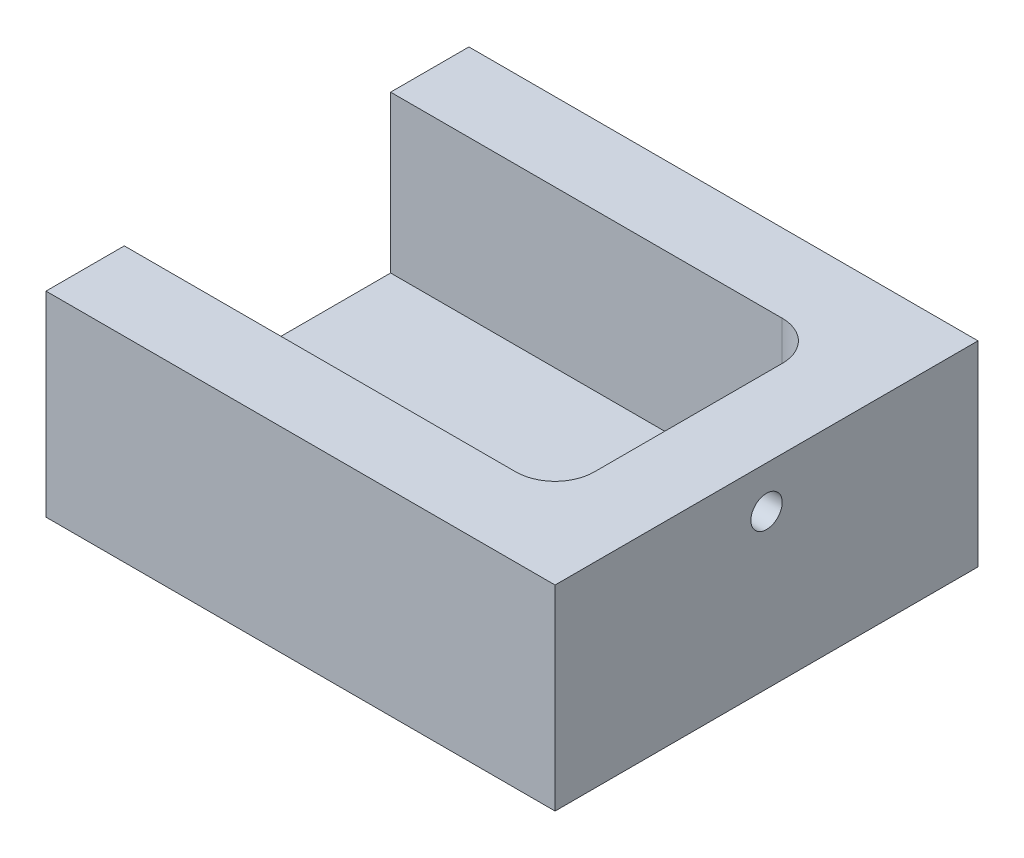
ISO-10303-21;
HEADER;
FILE_DESCRIPTION(('STEP AP214'),'2;1');
FILE_NAME('part.step','',(''),(''),'','','');
FILE_SCHEMA(('AUTOMOTIVE_DESIGN { 1 0 10303 214 1 1 1 1 }'));
ENDSEC;
DATA;
#1=APPLICATION_CONTEXT('core data for automotive mechanical design processes');
#2=APPLICATION_PROTOCOL_DEFINITION('international standard','automotive_design',2000,#1);
#3=PRODUCT_CONTEXT('',#1,'mechanical');
#4=PRODUCT('Part','Part','',(#3));
#5=PRODUCT_RELATED_PRODUCT_CATEGORY('part','',(#4));
#6=PRODUCT_DEFINITION_FORMATION('','',#4);
#7=PRODUCT_DEFINITION_CONTEXT('part definition',#1,'design');
#8=PRODUCT_DEFINITION('design','',#6,#7);
#9=PRODUCT_DEFINITION_SHAPE('','',#8);
#10=(LENGTH_UNIT() NAMED_UNIT(*) SI_UNIT(.MILLI.,.METRE.));
#11=(NAMED_UNIT(*) PLANE_ANGLE_UNIT() SI_UNIT($,.RADIAN.));
#12=(NAMED_UNIT(*) SI_UNIT($,.STERADIAN.) SOLID_ANGLE_UNIT());
#13=UNCERTAINTY_MEASURE_WITH_UNIT(LENGTH_MEASURE(1.E-05),#10,'distance_accuracy_value','');
#14=(GEOMETRIC_REPRESENTATION_CONTEXT(3) GLOBAL_UNCERTAINTY_ASSIGNED_CONTEXT((#13)) GLOBAL_UNIT_ASSIGNED_CONTEXT((#10,
#11,#12)) REPRESENTATION_CONTEXT('',''));
#15=CARTESIAN_POINT('',(0.,0.,0.));
#16=DIRECTION('',(0.,0.,1.));
#17=DIRECTION('',(1.,0.,0.));
#18=AXIS2_PLACEMENT_3D('',#15,#16,#17);
#19=CARTESIAN_POINT('',(0.,25.,0.));
#20=DIRECTION('',(1.,0.,0.));
#21=DIRECTION('',(0.,0.,-1.));
#22=AXIS2_PLACEMENT_3D('',#19,#20,#21);
#23=PLANE('',#22);
#24=DIRECTION('',(0.,0.,1.));
#25=VECTOR('',#24,1.);
#26=CARTESIAN_POINT('',(0.,5.,-44.));
#27=LINE('',#26,#25);
#28=CARTESIAN_POINT('',(0.,5.,-44.));
#29=VERTEX_POINT('',#28);
#30=CARTESIAN_POINT('',(0.,5.,-10.));
#31=VERTEX_POINT('',#30);
#32=EDGE_CURVE('E124',#29,#31,#27,.T.);
#33=ORIENTED_EDGE('',*,*,#32,.F.);
#34=DIRECTION('',(0.,1.,0.));
#35=VECTOR('',#34,1.);
#36=CARTESIAN_POINT('',(0.,5.,-44.));
#37=LINE('',#36,#35);
#38=CARTESIAN_POINT('',(0.,25.,-44.));
#39=VERTEX_POINT('',#38);
#40=EDGE_CURVE('E137',#29,#39,#37,.T.);
#41=ORIENTED_EDGE('',*,*,#40,.T.);
#42=DIRECTION('',(0.,0.,1.));
#43=VECTOR('',#42,1.);
#44=CARTESIAN_POINT('',(0.,25.,0.));
#45=LINE('',#44,#43);
#46=CARTESIAN_POINT('',(0.,25.,-54.));
#47=VERTEX_POINT('',#46);
#48=EDGE_CURVE('E144',#47,#39,#45,.T.);
#49=ORIENTED_EDGE('',*,*,#48,.F.);
#50=DIRECTION('',(0.,-1.,0.));
#51=VECTOR('',#50,1.);
#52=CARTESIAN_POINT('',(0.,25.,-54.));
#53=LINE('',#52,#51);
#54=CARTESIAN_POINT('',(0.,0.,-54.));
#55=VERTEX_POINT('',#54);
#56=EDGE_CURVE('E153',#47,#55,#53,.T.);
#57=ORIENTED_EDGE('',*,*,#56,.T.);
#58=DIRECTION('',(0.,0.,1.));
#59=VECTOR('',#58,1.);
#60=CARTESIAN_POINT('',(0.,0.,0.));
#61=LINE('',#60,#59);
#62=CARTESIAN_POINT('',(0.,0.,0.));
#63=VERTEX_POINT('',#62);
#64=EDGE_CURVE('E139',#55,#63,#61,.T.);
#65=ORIENTED_EDGE('',*,*,#64,.T.);
#66=DIRECTION('',(0.,-1.,0.));
#67=VECTOR('',#66,1.);
#68=CARTESIAN_POINT('',(0.,25.,0.));
#69=LINE('',#68,#67);
#70=CARTESIAN_POINT('',(0.,25.,0.));
#71=VERTEX_POINT('',#70);
#72=EDGE_CURVE('E170',#71,#63,#69,.T.);
#73=ORIENTED_EDGE('',*,*,#72,.F.);
#74=CARTESIAN_POINT('',(0.,25.,-10.));
#75=VERTEX_POINT('',#74);
#76=EDGE_CURVE('E136',#75,#71,#45,.T.);
#77=ORIENTED_EDGE('',*,*,#76,.F.);
#78=DIRECTION('',(0.,1.,0.));
#79=VECTOR('',#78,1.);
#80=CARTESIAN_POINT('',(0.,5.,-10.));
#81=LINE('',#80,#79);
#82=EDGE_CURVE('E118',#31,#75,#81,.T.);
#83=ORIENTED_EDGE('',*,*,#82,.F.);
#84=EDGE_LOOP('',(#33,#41,#49,#57,#65,#73,#77,#83));
#85=FACE_BOUND('',#84,.T.);
#86=ADVANCED_FACE('F37',(#85),#23,.F.);
#87=CARTESIAN_POINT('',(0.,25.,0.));
#88=DIRECTION('',(0.,0.,-1.));
#89=DIRECTION('',(-1.,0.,0.));
#90=AXIS2_PLACEMENT_3D('',#87,#88,#89);
#91=PLANE('',#90);
#92=DIRECTION('',(1.,0.,0.));
#93=VECTOR('',#92,1.);
#94=CARTESIAN_POINT('',(0.,0.,0.));
#95=LINE('',#94,#93);
#96=CARTESIAN_POINT('',(65.,0.,0.));
#97=VERTEX_POINT('',#96);
#98=EDGE_CURVE('E156',#63,#97,#95,.T.);
#99=ORIENTED_EDGE('',*,*,#98,.T.);
#100=DIRECTION('',(0.,-1.,0.));
#101=VECTOR('',#100,1.);
#102=CARTESIAN_POINT('',(65.,25.,0.));
#103=LINE('',#102,#101);
#104=CARTESIAN_POINT('',(65.,25.,0.));
#105=VERTEX_POINT('',#104);
#106=EDGE_CURVE('E167',#105,#97,#103,.T.);
#107=ORIENTED_EDGE('',*,*,#106,.F.);
#108=DIRECTION('',(1.,0.,0.));
#109=VECTOR('',#108,1.);
#110=CARTESIAN_POINT('',(0.,25.,0.));
#111=LINE('',#110,#109);
#112=EDGE_CURVE('E147',#71,#105,#111,.T.);
#113=ORIENTED_EDGE('',*,*,#112,.F.);
#114=ORIENTED_EDGE('',*,*,#72,.T.);
#115=EDGE_LOOP('',(#99,#107,#113,#114));
#116=FACE_BOUND('',#115,.T.);
#117=ADVANCED_FACE('F220',(#116),#91,.F.);
#118=CARTESIAN_POINT('',(65.,25.,0.));
#119=DIRECTION('',(-1.,0.,0.));
#120=DIRECTION('',(0.,0.,1.));
#121=AXIS2_PLACEMENT_3D('',#118,#119,#120);
#122=PLANE('',#121);
#123=CARTESIAN_POINT('',(65.,19.64,-27.));
#124=DIRECTION('',(1.,0.,0.));
#125=DIRECTION('',(0.,0.,-1.));
#126=AXIS2_PLACEMENT_3D('',#123,#124,#125);
#127=CIRCLE('',#126,2.);
#128=CARTESIAN_POINT('',(65.,19.64,-29.));
#129=VERTEX_POINT('',#128);
#130=EDGE_CURVE('E178',#129,#129,#127,.T.);
#131=ORIENTED_EDGE('',*,*,#130,.F.);
#132=EDGE_LOOP('',(#131));
#133=FACE_BOUND('',#132,.T.);
#134=DIRECTION('',(0.,0.,-1.));
#135=VECTOR('',#134,1.);
#136=CARTESIAN_POINT('',(65.,0.,0.));
#137=LINE('',#136,#135);
#138=CARTESIAN_POINT('',(65.,0.,-54.));
#139=VERTEX_POINT('',#138);
#140=EDGE_CURVE('E158',#97,#139,#137,.T.);
#141=ORIENTED_EDGE('',*,*,#140,.T.);
#142=DIRECTION('',(0.,-1.,0.));
#143=VECTOR('',#142,1.);
#144=CARTESIAN_POINT('',(65.,25.,-54.));
#145=LINE('',#144,#143);
#146=CARTESIAN_POINT('',(65.,25.,-54.));
#147=VERTEX_POINT('',#146);
#148=EDGE_CURVE('E164',#147,#139,#145,.T.);
#149=ORIENTED_EDGE('',*,*,#148,.F.);
#150=DIRECTION('',(0.,0.,-1.));
#151=VECTOR('',#150,1.);
#152=CARTESIAN_POINT('',(65.,25.,0.));
#153=LINE('',#152,#151);
#154=EDGE_CURVE('E149',#105,#147,#153,.T.);
#155=ORIENTED_EDGE('',*,*,#154,.F.);
#156=ORIENTED_EDGE('',*,*,#106,.T.);
#157=EDGE_LOOP('',(#141,#149,#155,#156));
#158=FACE_BOUND('',#157,.T.);
#159=ADVANCED_FACE('F222',(#133,#158),#122,.F.);
#160=CARTESIAN_POINT('',(0.,25.,-54.));
#161=DIRECTION('',(0.,0.,1.));
#162=DIRECTION('',(1.,0.,0.));
#163=AXIS2_PLACEMENT_3D('',#160,#161,#162);
#164=PLANE('',#163);
#165=DIRECTION('',(-1.,0.,0.));
#166=VECTOR('',#165,1.);
#167=CARTESIAN_POINT('',(0.,0.,-54.));
#168=LINE('',#167,#166);
#169=EDGE_CURVE('E160',#139,#55,#168,.T.);
#170=ORIENTED_EDGE('',*,*,#169,.T.);
#171=ORIENTED_EDGE('',*,*,#56,.F.);
#172=DIRECTION('',(-1.,0.,0.));
#173=VECTOR('',#172,1.);
#174=CARTESIAN_POINT('',(0.,25.,-54.));
#175=LINE('',#174,#173);
#176=EDGE_CURVE('E151',#147,#47,#175,.T.);
#177=ORIENTED_EDGE('',*,*,#176,.F.);
#178=ORIENTED_EDGE('',*,*,#148,.T.);
#179=EDGE_LOOP('',(#170,#171,#177,#178));
#180=FACE_BOUND('',#179,.T.);
#181=ADVANCED_FACE('F211',(#180),#164,.F.);
#182=CARTESIAN_POINT('',(0.,25.,0.));
#183=DIRECTION('',(0.,-1.,0.));
#184=DIRECTION('',(0.,0.,-1.));
#185=AXIS2_PLACEMENT_3D('',#182,#183,#184);
#186=PLANE('',#185);
#187=ORIENTED_EDGE('',*,*,#48,.T.);
#188=DIRECTION('',(-1.,0.,0.));
#189=VECTOR('',#188,1.);
#190=CARTESIAN_POINT('',(0.,25.,-44.));
#191=LINE('',#190,#189);
#192=CARTESIAN_POINT('',(50.,25.,-44.));
#193=VERTEX_POINT('',#192);
#194=EDGE_CURVE('E132',#193,#39,#191,.T.);
#195=ORIENTED_EDGE('',*,*,#194,.F.);
#196=CARTESIAN_POINT('',(50.,25.,-39.));
#197=DIRECTION('',(0.,-1.,0.));
#198=DIRECTION('',(0.,0.,-1.));
#199=AXIS2_PLACEMENT_3D('',#196,#197,#198);
#200=CIRCLE('',#199,5.);
#201=CARTESIAN_POINT('',(55.,25.,-39.));
#202=VERTEX_POINT('',#201);
#203=EDGE_CURVE('E11',#193,#202,#200,.T.);
#204=ORIENTED_EDGE('',*,*,#203,.T.);
#205=DIRECTION('',(0.,0.,-1.));
#206=VECTOR('',#205,1.);
#207=CARTESIAN_POINT('',(55.,25.,-44.));
#208=LINE('',#207,#206);
#209=CARTESIAN_POINT('',(55.,25.,-15.));
#210=VERTEX_POINT('',#209);
#211=EDGE_CURVE('E192',#210,#202,#208,.T.);
#212=ORIENTED_EDGE('',*,*,#211,.F.);
#213=CARTESIAN_POINT('',(50.,25.,-15.));
#214=DIRECTION('',(0.,-1.,0.));
#215=DIRECTION('',(0.,0.,-1.));
#216=AXIS2_PLACEMENT_3D('',#213,#214,#215);
#217=CIRCLE('',#216,5.);
#218=CARTESIAN_POINT('',(50.,25.,-10.));
#219=VERTEX_POINT('',#218);
#220=EDGE_CURVE('E45',#210,#219,#217,.T.);
#221=ORIENTED_EDGE('',*,*,#220,.T.);
#222=DIRECTION('',(1.,0.,0.));
#223=VECTOR('',#222,1.);
#224=CARTESIAN_POINT('',(0.,25.,-10.));
#225=LINE('',#224,#223);
#226=EDGE_CURVE('E177',#75,#219,#225,.T.);
#227=ORIENTED_EDGE('',*,*,#226,.F.);
#228=ORIENTED_EDGE('',*,*,#76,.T.);
#229=ORIENTED_EDGE('',*,*,#112,.T.);
#230=ORIENTED_EDGE('',*,*,#154,.T.);
#231=ORIENTED_EDGE('',*,*,#176,.T.);
#232=EDGE_LOOP('',(#187,#195,#204,#212,#221,#227,#228,#229,#230,#231));
#233=FACE_BOUND('',#232,.T.);
#234=ADVANCED_FACE('F190',(#233),#186,.F.);
#235=CARTESIAN_POINT('',(0.,0.,0.));
#236=DIRECTION('',(0.,-1.,0.));
#237=DIRECTION('',(0.,0.,-1.));
#238=AXIS2_PLACEMENT_3D('',#235,#236,#237);
#239=PLANE('',#238);
#240=ORIENTED_EDGE('',*,*,#64,.F.);
#241=ORIENTED_EDGE('',*,*,#169,.F.);
#242=ORIENTED_EDGE('',*,*,#140,.F.);
#243=ORIENTED_EDGE('',*,*,#98,.F.);
#244=EDGE_LOOP('',(#240,#241,#242,#243));
#245=FACE_BOUND('',#244,.T.);
#246=ADVANCED_FACE('F215',(#245),#239,.T.);
#247=CARTESIAN_POINT('',(0.,5.,-44.));
#248=DIRECTION('',(0.,0.,-1.));
#249=DIRECTION('',(-1.,0.,0.));
#250=AXIS2_PLACEMENT_3D('',#247,#248,#249);
#251=PLANE('',#250);
#252=DIRECTION('',(-1.,0.,0.));
#253=VECTOR('',#252,1.);
#254=CARTESIAN_POINT('',(0.,5.,-44.));
#255=LINE('',#254,#253);
#256=CARTESIAN_POINT('',(50.,5.,-44.));
#257=VERTEX_POINT('',#256);
#258=EDGE_CURVE('E128',#257,#29,#255,.T.);
#259=ORIENTED_EDGE('',*,*,#258,.F.);
#260=DIRECTION('',(0.,1.,0.));
#261=VECTOR('',#260,1.);
#262=CARTESIAN_POINT('',(50.,25.,-44.));
#263=LINE('',#262,#261);
#264=EDGE_CURVE('E187',#257,#193,#263,.T.);
#265=ORIENTED_EDGE('',*,*,#264,.T.);
#266=ORIENTED_EDGE('',*,*,#194,.T.);
#267=ORIENTED_EDGE('',*,*,#40,.F.);
#268=EDGE_LOOP('',(#259,#265,#266,#267));
#269=FACE_BOUND('',#268,.T.);
#270=ADVANCED_FACE('F204',(#269),#251,.F.);
#271=CARTESIAN_POINT('',(55.,5.,-44.));
#272=DIRECTION('',(1.,0.,0.));
#273=DIRECTION('',(0.,0.,-1.));
#274=AXIS2_PLACEMENT_3D('',#271,#272,#273);
#275=PLANE('',#274);
#276=CARTESIAN_POINT('',(55.,19.64,-27.));
#277=DIRECTION('',(1.,0.,0.));
#278=DIRECTION('',(0.,0.,-1.));
#279=AXIS2_PLACEMENT_3D('',#276,#277,#278);
#280=CIRCLE('',#279,2.);
#281=CARTESIAN_POINT('',(55.,19.64,-29.));
#282=VERTEX_POINT('',#281);
#283=EDGE_CURVE('E174',#282,#282,#280,.T.);
#284=ORIENTED_EDGE('',*,*,#283,.T.);
#285=EDGE_LOOP('',(#284));
#286=FACE_BOUND('',#285,.T.);
#287=DIRECTION('',(0.,0.,-1.));
#288=VECTOR('',#287,1.);
#289=CARTESIAN_POINT('',(55.,5.,-44.));
#290=LINE('',#289,#288);
#291=CARTESIAN_POINT('',(55.,5.,-15.));
#292=VERTEX_POINT('',#291);
#293=CARTESIAN_POINT('',(55.,5.,-39.));
#294=VERTEX_POINT('',#293);
#295=EDGE_CURVE('E123',#292,#294,#290,.T.);
#296=ORIENTED_EDGE('',*,*,#295,.F.);
#297=DIRECTION('',(0.,1.,0.));
#298=VECTOR('',#297,1.);
#299=CARTESIAN_POINT('',(55.,25.,-15.));
#300=LINE('',#299,#298);
#301=EDGE_CURVE('E180',#292,#210,#300,.T.);
#302=ORIENTED_EDGE('',*,*,#301,.T.);
#303=ORIENTED_EDGE('',*,*,#211,.T.);
#304=DIRECTION('',(0.,1.,0.));
#305=VECTOR('',#304,1.);
#306=CARTESIAN_POINT('',(55.,5.,-39.));
#307=LINE('',#306,#305);
#308=EDGE_CURVE('E173',#202,#294,#307,.F.);
#309=ORIENTED_EDGE('',*,*,#308,.T.);
#310=EDGE_LOOP('',(#296,#302,#303,#309));
#311=FACE_BOUND('',#310,.T.);
#312=ADVANCED_FACE('F199',(#286,#311),#275,.F.);
#313=CARTESIAN_POINT('',(0.,5.,-10.));
#314=DIRECTION('',(0.,0.,1.));
#315=DIRECTION('',(1.,0.,0.));
#316=AXIS2_PLACEMENT_3D('',#313,#314,#315);
#317=PLANE('',#316);
#318=ORIENTED_EDGE('',*,*,#226,.T.);
#319=DIRECTION('',(0.,1.,0.));
#320=VECTOR('',#319,1.);
#321=CARTESIAN_POINT('',(50.,5.,-10.));
#322=LINE('',#321,#320);
#323=CARTESIAN_POINT('',(50.,5.,-10.));
#324=VERTEX_POINT('',#323);
#325=EDGE_CURVE('E121',#219,#324,#322,.F.);
#326=ORIENTED_EDGE('',*,*,#325,.T.);
#327=DIRECTION('',(1.,0.,0.));
#328=VECTOR('',#327,1.);
#329=CARTESIAN_POINT('',(0.,5.,-10.));
#330=LINE('',#329,#328);
#331=EDGE_CURVE('E113',#31,#324,#330,.T.);
#332=ORIENTED_EDGE('',*,*,#331,.F.);
#333=ORIENTED_EDGE('',*,*,#82,.T.);
#334=EDGE_LOOP('',(#318,#326,#332,#333));
#335=FACE_BOUND('',#334,.T.);
#336=ADVANCED_FACE('F116',(#335),#317,.F.);
#337=CARTESIAN_POINT('',(0.,5.,0.));
#338=DIRECTION('',(0.,1.,0.));
#339=DIRECTION('',(0.,0.,1.));
#340=AXIS2_PLACEMENT_3D('',#337,#338,#339);
#341=PLANE('',#340);
#342=ORIENTED_EDGE('',*,*,#331,.T.);
#343=CARTESIAN_POINT('',(50.,5.,-15.));
#344=DIRECTION('',(0.,1.,0.));
#345=DIRECTION('',(0.,0.,1.));
#346=AXIS2_PLACEMENT_3D('',#343,#344,#345);
#347=CIRCLE('',#346,5.);
#348=EDGE_CURVE('E185',#324,#292,#347,.T.);
#349=ORIENTED_EDGE('',*,*,#348,.T.);
#350=ORIENTED_EDGE('',*,*,#295,.T.);
#351=CARTESIAN_POINT('',(50.,5.,-39.));
#352=DIRECTION('',(0.,1.,0.));
#353=DIRECTION('',(0.,0.,1.));
#354=AXIS2_PLACEMENT_3D('',#351,#352,#353);
#355=CIRCLE('',#354,5.);
#356=EDGE_CURVE('E58',#294,#257,#355,.T.);
#357=ORIENTED_EDGE('',*,*,#356,.T.);
#358=ORIENTED_EDGE('',*,*,#258,.T.);
#359=ORIENTED_EDGE('',*,*,#32,.T.);
#360=EDGE_LOOP('',(#342,#349,#350,#357,#358,#359));
#361=FACE_BOUND('',#360,.T.);
#362=ADVANCED_FACE('F127',(#361),#341,.T.);
#363=CARTESIAN_POINT('',(0.,19.64,-27.));
#364=DIRECTION('',(1.,0.,0.));
#365=DIRECTION('',(0.,0.,-1.));
#366=AXIS2_PLACEMENT_3D('',#363,#364,#365);
#367=CYLINDRICAL_SURFACE('',#366,2.);
#368=ORIENTED_EDGE('',*,*,#130,.T.);
#369=EDGE_LOOP('',(#368));
#370=FACE_BOUND('',#369,.T.);
#371=ORIENTED_EDGE('',*,*,#283,.F.);
#372=EDGE_LOOP('',(#371));
#373=FACE_BOUND('',#372,.T.);
#374=ADVANCED_FACE('F238',(#370,#373),#367,.F.);
#375=CARTESIAN_POINT('',(50.,5.,-15.));
#376=DIRECTION('',(0.,-1.,0.));
#377=DIRECTION('',(0.,0.,-1.));
#378=AXIS2_PLACEMENT_3D('',#375,#376,#377);
#379=CYLINDRICAL_SURFACE('',#378,5.);
#380=ORIENTED_EDGE('',*,*,#348,.F.);
#381=ORIENTED_EDGE('',*,*,#325,.F.);
#382=ORIENTED_EDGE('',*,*,#220,.F.);
#383=ORIENTED_EDGE('',*,*,#301,.F.);
#384=EDGE_LOOP('',(#380,#381,#382,#383));
#385=FACE_BOUND('',#384,.T.);
#386=ADVANCED_FACE('F196',(#385),#379,.F.);
#387=CARTESIAN_POINT('',(50.,5.,-39.));
#388=DIRECTION('',(0.,-1.,0.));
#389=DIRECTION('',(0.,0.,-1.));
#390=AXIS2_PLACEMENT_3D('',#387,#388,#389);
#391=CYLINDRICAL_SURFACE('',#390,5.);
#392=ORIENTED_EDGE('',*,*,#356,.F.);
#393=ORIENTED_EDGE('',*,*,#308,.F.);
#394=ORIENTED_EDGE('',*,*,#203,.F.);
#395=ORIENTED_EDGE('',*,*,#264,.F.);
#396=EDGE_LOOP('',(#392,#393,#394,#395));
#397=FACE_BOUND('',#396,.T.);
#398=ADVANCED_FACE('F39',(#397),#391,.F.);
#399=CLOSED_SHELL('',(#86,#117,#159,#181,#234,#246,#270,#312,#336,#362,#374,#386,#398));
#400=MANIFOLD_SOLID_BREP('B2',#399);
#401=ADVANCED_BREP_SHAPE_REPRESENTATION('',(#18,#400),#14);
#402=SHAPE_DEFINITION_REPRESENTATION(#9,#401);
ENDSEC;
END-ISO-10303-21;
